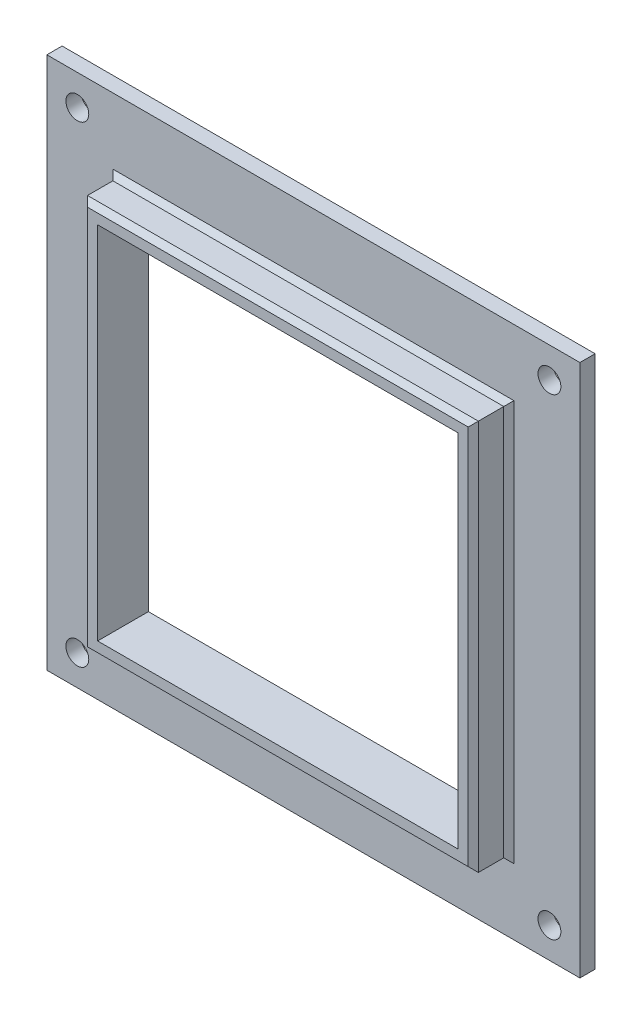
ISO-10303-21;
HEADER;
FILE_DESCRIPTION(('STEP AP214'),'2;1');
FILE_NAME('part.step','',(''),(''),'','','');
FILE_SCHEMA(('AUTOMOTIVE_DESIGN { 1 0 10303 214 1 1 1 1 }'));
ENDSEC;
DATA;
#1=APPLICATION_CONTEXT('core data for automotive mechanical design processes');
#2=APPLICATION_PROTOCOL_DEFINITION('international standard','automotive_design',2000,#1);
#3=PRODUCT_CONTEXT('',#1,'mechanical');
#4=PRODUCT('Part','Part','',(#3));
#5=PRODUCT_RELATED_PRODUCT_CATEGORY('part','',(#4));
#6=PRODUCT_DEFINITION_FORMATION('','',#4);
#7=PRODUCT_DEFINITION_CONTEXT('part definition',#1,'design');
#8=PRODUCT_DEFINITION('design','',#6,#7);
#9=PRODUCT_DEFINITION_SHAPE('','',#8);
#10=(LENGTH_UNIT() NAMED_UNIT(*) SI_UNIT(.MILLI.,.METRE.));
#11=(NAMED_UNIT(*) PLANE_ANGLE_UNIT() SI_UNIT($,.RADIAN.));
#12=(NAMED_UNIT(*) SI_UNIT($,.STERADIAN.) SOLID_ANGLE_UNIT());
#13=UNCERTAINTY_MEASURE_WITH_UNIT(LENGTH_MEASURE(1.E-05),#10,'distance_accuracy_value','');
#14=(GEOMETRIC_REPRESENTATION_CONTEXT(3) GLOBAL_UNCERTAINTY_ASSIGNED_CONTEXT((#13)) GLOBAL_UNIT_ASSIGNED_CONTEXT((#10,
#11,#12)) REPRESENTATION_CONTEXT('',''));
#15=CARTESIAN_POINT('',(0.,0.,0.));
#16=DIRECTION('',(0.,0.,1.));
#17=DIRECTION('',(1.,0.,0.));
#18=AXIS2_PLACEMENT_3D('',#15,#16,#17);
#19=CARTESIAN_POINT('',(0.,0.,3.));
#20=DIRECTION('',(0.,0.,1.));
#21=DIRECTION('',(1.,0.,0.));
#22=AXIS2_PLACEMENT_3D('',#19,#20,#21);
#23=PLANE('',#22);
#24=CARTESIAN_POINT('',(-11.,-11.,3.));
#25=DIRECTION('',(0.,0.,1.));
#26=DIRECTION('',(1.,0.,0.));
#27=AXIS2_PLACEMENT_3D('',#24,#25,#26);
#28=CIRCLE('',#27,2.25);
#29=CARTESIAN_POINT('',(-8.74999999999995,-11.,3.));
#30=VERTEX_POINT('',#29);
#31=EDGE_CURVE('E486',#30,#30,#28,.T.);
#32=ORIENTED_EDGE('',*,*,#31,.F.);
#33=EDGE_LOOP('',(#32));
#34=FACE_BOUND('',#33,.T.);
#35=CARTESIAN_POINT('',(81.9999999999999,-11.,3.));
#36=DIRECTION('',(0.,0.,1.));
#37=DIRECTION('',(1.,0.,0.));
#38=AXIS2_PLACEMENT_3D('',#35,#36,#37);
#39=CIRCLE('',#38,2.25);
#40=CARTESIAN_POINT('',(84.2499999999999,-11.,3.));
#41=VERTEX_POINT('',#40);
#42=EDGE_CURVE('E488',#41,#41,#39,.T.);
#43=ORIENTED_EDGE('',*,*,#42,.F.);
#44=EDGE_LOOP('',(#43));
#45=FACE_BOUND('',#44,.T.);
#46=CARTESIAN_POINT('',(81.9999999999999,82.,3.));
#47=DIRECTION('',(0.,0.,1.));
#48=DIRECTION('',(1.,0.,0.));
#49=AXIS2_PLACEMENT_3D('',#46,#47,#48);
#50=CIRCLE('',#49,2.25);
#51=CARTESIAN_POINT('',(84.2499999999999,82.,3.));
#52=VERTEX_POINT('',#51);
#53=EDGE_CURVE('E494',#52,#52,#50,.T.);
#54=ORIENTED_EDGE('',*,*,#53,.F.);
#55=EDGE_LOOP('',(#54));
#56=FACE_BOUND('',#55,.T.);
#57=CARTESIAN_POINT('',(-11.,82.,3.));
#58=DIRECTION('',(0.,0.,1.));
#59=DIRECTION('',(1.,0.,0.));
#60=AXIS2_PLACEMENT_3D('',#57,#58,#59);
#61=CIRCLE('',#60,2.25);
#62=CARTESIAN_POINT('',(-8.74999999999996,82.,3.));
#63=VERTEX_POINT('',#62);
#64=EDGE_CURVE('E500',#63,#63,#61,.T.);
#65=ORIENTED_EDGE('',*,*,#64,.F.);
#66=EDGE_LOOP('',(#65));
#67=FACE_BOUND('',#66,.T.);
#68=DIRECTION('',(0.,1.,0.));
#69=VECTOR('',#68,1.);
#70=CARTESIAN_POINT('',(-3.99999999999999,0.,3.));
#71=LINE('',#70,#69);
#72=CARTESIAN_POINT('',(-3.99999999999999,-4.,3.));
#73=VERTEX_POINT('',#72);
#74=CARTESIAN_POINT('',(-4.,75.,3.));
#75=VERTEX_POINT('',#74);
#76=EDGE_CURVE('E249',#73,#75,#71,.T.);
#77=ORIENTED_EDGE('',*,*,#76,.T.);
#78=DIRECTION('',(1.,0.,0.));
#79=VECTOR('',#78,1.);
#80=CARTESIAN_POINT('',(0.,75.,3.));
#81=LINE('',#80,#79);
#82=CARTESIAN_POINT('',(75.,75.,3.));
#83=VERTEX_POINT('',#82);
#84=EDGE_CURVE('E251',#75,#83,#81,.T.);
#85=ORIENTED_EDGE('',*,*,#84,.T.);
#86=DIRECTION('',(0.,-1.,0.));
#87=VECTOR('',#86,1.);
#88=CARTESIAN_POINT('',(75.,0.,3.));
#89=LINE('',#88,#87);
#90=CARTESIAN_POINT('',(75.,-4.,3.));
#91=VERTEX_POINT('',#90);
#92=EDGE_CURVE('E247',#83,#91,#89,.T.);
#93=ORIENTED_EDGE('',*,*,#92,.T.);
#94=DIRECTION('',(-1.,0.,0.));
#95=VECTOR('',#94,1.);
#96=CARTESIAN_POINT('',(0.,-4.,3.));
#97=LINE('',#96,#95);
#98=EDGE_CURVE('E245',#91,#73,#97,.T.);
#99=ORIENTED_EDGE('',*,*,#98,.T.);
#100=EDGE_LOOP('',(#77,#85,#93,#99));
#101=FACE_BOUND('',#100,.T.);
#102=DIRECTION('',(0.,-1.,0.));
#103=VECTOR('',#102,1.);
#104=CARTESIAN_POINT('',(-17.,88.,3.));
#105=LINE('',#104,#103);
#106=CARTESIAN_POINT('',(-17.,88.,3.));
#107=VERTEX_POINT('',#106);
#108=CARTESIAN_POINT('',(-16.9999999999999,-17.,3.));
#109=VERTEX_POINT('',#108);
#110=EDGE_CURVE('E210',#107,#109,#105,.T.);
#111=ORIENTED_EDGE('',*,*,#110,.T.);
#112=DIRECTION('',(1.,0.,0.));
#113=VECTOR('',#112,1.);
#114=CARTESIAN_POINT('',(-16.9999999999999,-17.,3.));
#115=LINE('',#114,#113);
#116=CARTESIAN_POINT('',(88.,-17.,3.));
#117=VERTEX_POINT('',#116);
#118=EDGE_CURVE('E213',#109,#117,#115,.T.);
#119=ORIENTED_EDGE('',*,*,#118,.T.);
#120=DIRECTION('',(0.,1.,0.));
#121=VECTOR('',#120,1.);
#122=CARTESIAN_POINT('',(87.9999999999999,88.,3.));
#123=LINE('',#122,#121);
#124=CARTESIAN_POINT('',(87.9999999999999,88.,3.));
#125=VERTEX_POINT('',#124);
#126=EDGE_CURVE('E216',#117,#125,#123,.T.);
#127=ORIENTED_EDGE('',*,*,#126,.T.);
#128=DIRECTION('',(-1.,0.,0.));
#129=VECTOR('',#128,1.);
#130=CARTESIAN_POINT('',(-17.,88.,3.));
#131=LINE('',#130,#129);
#132=EDGE_CURVE('E218',#125,#107,#131,.T.);
#133=ORIENTED_EDGE('',*,*,#132,.T.);
#134=EDGE_LOOP('',(#111,#119,#127,#133));
#135=FACE_BOUND('',#134,.T.);
#136=ADVANCED_FACE('F37',(#34,#45,#56,#67,#101,#135),#23,.T.);
#137=CARTESIAN_POINT('',(0.,0.,0.));
#138=DIRECTION('',(0.,0.,1.));
#139=DIRECTION('',(1.,0.,0.));
#140=AXIS2_PLACEMENT_3D('',#137,#138,#139);
#141=PLANE('',#140);
#142=CARTESIAN_POINT('',(-11.,-11.,0.));
#143=DIRECTION('',(0.,0.,1.));
#144=DIRECTION('',(1.,0.,0.));
#145=AXIS2_PLACEMENT_3D('',#142,#143,#144);
#146=CIRCLE('',#145,2.25);
#147=CARTESIAN_POINT('',(-8.74999999999995,-11.,0.));
#148=VERTEX_POINT('',#147);
#149=EDGE_CURVE('E484',#148,#148,#146,.T.);
#150=ORIENTED_EDGE('',*,*,#149,.T.);
#151=EDGE_LOOP('',(#150));
#152=FACE_BOUND('',#151,.T.);
#153=CARTESIAN_POINT('',(81.9999999999999,-11.,0.));
#154=DIRECTION('',(0.,0.,1.));
#155=DIRECTION('',(1.,0.,0.));
#156=AXIS2_PLACEMENT_3D('',#153,#154,#155);
#157=CIRCLE('',#156,2.25);
#158=CARTESIAN_POINT('',(84.2499999999999,-11.,0.));
#159=VERTEX_POINT('',#158);
#160=EDGE_CURVE('E491',#159,#159,#157,.T.);
#161=ORIENTED_EDGE('',*,*,#160,.T.);
#162=EDGE_LOOP('',(#161));
#163=FACE_BOUND('',#162,.T.);
#164=CARTESIAN_POINT('',(81.9999999999999,82.,0.));
#165=DIRECTION('',(0.,0.,1.));
#166=DIRECTION('',(1.,0.,0.));
#167=AXIS2_PLACEMENT_3D('',#164,#165,#166);
#168=CIRCLE('',#167,2.25);
#169=CARTESIAN_POINT('',(84.2499999999999,82.,0.));
#170=VERTEX_POINT('',#169);
#171=EDGE_CURVE('E497',#170,#170,#168,.T.);
#172=ORIENTED_EDGE('',*,*,#171,.T.);
#173=EDGE_LOOP('',(#172));
#174=FACE_BOUND('',#173,.T.);
#175=CARTESIAN_POINT('',(-11.,82.,0.));
#176=DIRECTION('',(0.,0.,1.));
#177=DIRECTION('',(1.,0.,0.));
#178=AXIS2_PLACEMENT_3D('',#175,#176,#177);
#179=CIRCLE('',#178,2.25);
#180=CARTESIAN_POINT('',(-8.74999999999996,82.,0.));
#181=VERTEX_POINT('',#180);
#182=EDGE_CURVE('E282',#181,#181,#179,.T.);
#183=ORIENTED_EDGE('',*,*,#182,.T.);
#184=EDGE_LOOP('',(#183));
#185=FACE_BOUND('',#184,.T.);
#186=DIRECTION('',(0.,-1.,0.));
#187=VECTOR('',#186,1.);
#188=CARTESIAN_POINT('',(-17.,88.,0.));
#189=LINE('',#188,#187);
#190=CARTESIAN_POINT('',(-17.,88.,0.));
#191=VERTEX_POINT('',#190);
#192=CARTESIAN_POINT('',(-16.9999999999999,-17.,0.));
#193=VERTEX_POINT('',#192);
#194=EDGE_CURVE('E209',#191,#193,#189,.T.);
#195=ORIENTED_EDGE('',*,*,#194,.F.);
#196=DIRECTION('',(-1.,0.,0.));
#197=VECTOR('',#196,1.);
#198=CARTESIAN_POINT('',(-17.,88.,0.));
#199=LINE('',#198,#197);
#200=CARTESIAN_POINT('',(87.9999999999999,88.,0.));
#201=VERTEX_POINT('',#200);
#202=EDGE_CURVE('E214',#201,#191,#199,.T.);
#203=ORIENTED_EDGE('',*,*,#202,.F.);
#204=DIRECTION('',(0.,1.,0.));
#205=VECTOR('',#204,1.);
#206=CARTESIAN_POINT('',(87.9999999999999,88.,0.));
#207=LINE('',#206,#205);
#208=CARTESIAN_POINT('',(88.,-17.,0.));
#209=VERTEX_POINT('',#208);
#210=EDGE_CURVE('E225',#209,#201,#207,.T.);
#211=ORIENTED_EDGE('',*,*,#210,.F.);
#212=DIRECTION('',(1.,0.,0.));
#213=VECTOR('',#212,1.);
#214=CARTESIAN_POINT('',(-16.9999999999999,-17.,0.));
#215=LINE('',#214,#213);
#216=EDGE_CURVE('E223',#193,#209,#215,.T.);
#217=ORIENTED_EDGE('',*,*,#216,.F.);
#218=EDGE_LOOP('',(#195,#203,#211,#217));
#219=FACE_BOUND('',#218,.T.);
#220=DIRECTION('',(0.,-1.,0.));
#221=VECTOR('',#220,1.);
#222=CARTESIAN_POINT('',(0.,0.,0.));
#223=LINE('',#222,#221);
#224=CARTESIAN_POINT('',(0.,71.,0.));
#225=VERTEX_POINT('',#224);
#226=CARTESIAN_POINT('',(0.,0.,0.));
#227=VERTEX_POINT('',#226);
#228=EDGE_CURVE('E195',#225,#227,#223,.T.);
#229=ORIENTED_EDGE('',*,*,#228,.T.);
#230=DIRECTION('',(1.,0.,0.));
#231=VECTOR('',#230,1.);
#232=CARTESIAN_POINT('',(0.,0.,0.));
#233=LINE('',#232,#231);
#234=CARTESIAN_POINT('',(71.,0.,0.));
#235=VERTEX_POINT('',#234);
#236=EDGE_CURVE('E198',#227,#235,#233,.T.);
#237=ORIENTED_EDGE('',*,*,#236,.T.);
#238=DIRECTION('',(0.,1.,0.));
#239=VECTOR('',#238,1.);
#240=CARTESIAN_POINT('',(71.,0.,0.));
#241=LINE('',#240,#239);
#242=CARTESIAN_POINT('',(71.,71.,0.));
#243=VERTEX_POINT('',#242);
#244=EDGE_CURVE('E159',#235,#243,#241,.T.);
#245=ORIENTED_EDGE('',*,*,#244,.T.);
#246=DIRECTION('',(-1.,0.,0.));
#247=VECTOR('',#246,1.);
#248=CARTESIAN_POINT('',(0.,71.,0.));
#249=LINE('',#248,#247);
#250=EDGE_CURVE('E201',#243,#225,#249,.T.);
#251=ORIENTED_EDGE('',*,*,#250,.T.);
#252=EDGE_LOOP('',(#229,#237,#245,#251));
#253=FACE_BOUND('',#252,.T.);
#254=ADVANCED_FACE('F340',(#152,#163,#174,#185,#219,#253),#141,.F.);
#255=CARTESIAN_POINT('',(-17.,88.,3.));
#256=DIRECTION('',(1.,0.,0.));
#257=DIRECTION('',(0.,1.,0.));
#258=AXIS2_PLACEMENT_3D('',#255,#256,#257);
#259=PLANE('',#258);
#260=ORIENTED_EDGE('',*,*,#194,.T.);
#261=DIRECTION('',(0.,0.,-1.));
#262=VECTOR('',#261,1.);
#263=CARTESIAN_POINT('',(-16.9999999999999,-17.,3.));
#264=LINE('',#263,#262);
#265=EDGE_CURVE('E236',#109,#193,#264,.T.);
#266=ORIENTED_EDGE('',*,*,#265,.F.);
#267=ORIENTED_EDGE('',*,*,#110,.F.);
#268=DIRECTION('',(0.,0.,-1.));
#269=VECTOR('',#268,1.);
#270=CARTESIAN_POINT('',(-17.,88.,3.));
#271=LINE('',#270,#269);
#272=EDGE_CURVE('E220',#107,#191,#271,.T.);
#273=ORIENTED_EDGE('',*,*,#272,.T.);
#274=EDGE_LOOP('',(#260,#266,#267,#273));
#275=FACE_BOUND('',#274,.T.);
#276=ADVANCED_FACE('F346',(#275),#259,.F.);
#277=CARTESIAN_POINT('',(-16.9999999999999,-17.,3.));
#278=DIRECTION('',(0.,1.,0.));
#279=DIRECTION('',(-1.,0.,0.));
#280=AXIS2_PLACEMENT_3D('',#277,#278,#279);
#281=PLANE('',#280);
#282=ORIENTED_EDGE('',*,*,#216,.T.);
#283=DIRECTION('',(0.,0.,-1.));
#284=VECTOR('',#283,1.);
#285=CARTESIAN_POINT('',(88.,-17.,3.));
#286=LINE('',#285,#284);
#287=EDGE_CURVE('E233',#117,#209,#286,.T.);
#288=ORIENTED_EDGE('',*,*,#287,.F.);
#289=ORIENTED_EDGE('',*,*,#118,.F.);
#290=ORIENTED_EDGE('',*,*,#265,.T.);
#291=EDGE_LOOP('',(#282,#288,#289,#290));
#292=FACE_BOUND('',#291,.T.);
#293=ADVANCED_FACE('F362',(#292),#281,.F.);
#294=CARTESIAN_POINT('',(87.9999999999999,88.,3.));
#295=DIRECTION('',(-1.,0.,0.));
#296=DIRECTION('',(0.,-1.,0.));
#297=AXIS2_PLACEMENT_3D('',#294,#295,#296);
#298=PLANE('',#297);
#299=ORIENTED_EDGE('',*,*,#210,.T.);
#300=DIRECTION('',(0.,0.,-1.));
#301=VECTOR('',#300,1.);
#302=CARTESIAN_POINT('',(87.9999999999999,88.,3.));
#303=LINE('',#302,#301);
#304=EDGE_CURVE('E230',#125,#201,#303,.T.);
#305=ORIENTED_EDGE('',*,*,#304,.F.);
#306=ORIENTED_EDGE('',*,*,#126,.F.);
#307=ORIENTED_EDGE('',*,*,#287,.T.);
#308=EDGE_LOOP('',(#299,#305,#306,#307));
#309=FACE_BOUND('',#308,.T.);
#310=ADVANCED_FACE('F358',(#309),#298,.F.);
#311=CARTESIAN_POINT('',(-17.,88.,3.));
#312=DIRECTION('',(0.,-1.,0.));
#313=DIRECTION('',(1.,0.,0.));
#314=AXIS2_PLACEMENT_3D('',#311,#312,#313);
#315=PLANE('',#314);
#316=ORIENTED_EDGE('',*,*,#202,.T.);
#317=ORIENTED_EDGE('',*,*,#272,.F.);
#318=ORIENTED_EDGE('',*,*,#132,.F.);
#319=ORIENTED_EDGE('',*,*,#304,.T.);
#320=EDGE_LOOP('',(#316,#317,#318,#319));
#321=FACE_BOUND('',#320,.T.);
#322=ADVANCED_FACE('F355',(#321),#315,.F.);
#323=CARTESIAN_POINT('',(0.,0.,3.));
#324=DIRECTION('',(1.,0.,0.));
#325=DIRECTION('',(0.,0.,-1.));
#326=AXIS2_PLACEMENT_3D('',#323,#324,#325);
#327=PLANE('',#326);
#328=ORIENTED_EDGE('',*,*,#228,.F.);
#329=DIRECTION('',(0.,0.,-1.));
#330=VECTOR('',#329,1.);
#331=CARTESIAN_POINT('',(0.,71.,3.));
#332=LINE('',#331,#330);
#333=CARTESIAN_POINT('',(0.,71.,10.));
#334=VERTEX_POINT('',#333);
#335=EDGE_CURVE('E204',#334,#225,#332,.T.);
#336=ORIENTED_EDGE('',*,*,#335,.F.);
#337=DIRECTION('',(0.,-1.,0.));
#338=VECTOR('',#337,1.);
#339=CARTESIAN_POINT('',(0.,71.,10.));
#340=LINE('',#339,#338);
#341=CARTESIAN_POINT('',(0.,0.,10.));
#342=VERTEX_POINT('',#341);
#343=EDGE_CURVE('E178',#334,#342,#340,.T.);
#344=ORIENTED_EDGE('',*,*,#343,.T.);
#345=DIRECTION('',(0.,0.,-1.));
#346=VECTOR('',#345,1.);
#347=CARTESIAN_POINT('',(0.,0.,3.));
#348=LINE('',#347,#346);
#349=EDGE_CURVE('E162',#342,#227,#348,.T.);
#350=ORIENTED_EDGE('',*,*,#349,.T.);
#351=EDGE_LOOP('',(#328,#336,#344,#350));
#352=FACE_BOUND('',#351,.T.);
#353=ADVANCED_FACE('F352',(#352),#327,.T.);
#354=CARTESIAN_POINT('',(0.,0.,3.));
#355=DIRECTION('',(0.,1.,0.));
#356=DIRECTION('',(0.,0.,1.));
#357=AXIS2_PLACEMENT_3D('',#354,#355,#356);
#358=PLANE('',#357);
#359=ORIENTED_EDGE('',*,*,#236,.F.);
#360=ORIENTED_EDGE('',*,*,#349,.F.);
#361=DIRECTION('',(1.,0.,0.));
#362=VECTOR('',#361,1.);
#363=CARTESIAN_POINT('',(0.,0.,10.));
#364=LINE('',#363,#362);
#365=CARTESIAN_POINT('',(71.,0.,10.));
#366=VERTEX_POINT('',#365);
#367=EDGE_CURVE('E166',#342,#366,#364,.T.);
#368=ORIENTED_EDGE('',*,*,#367,.T.);
#369=DIRECTION('',(0.,0.,-1.));
#370=VECTOR('',#369,1.);
#371=CARTESIAN_POINT('',(71.,0.,3.));
#372=LINE('',#371,#370);
#373=EDGE_CURVE('E152',#366,#235,#372,.T.);
#374=ORIENTED_EDGE('',*,*,#373,.T.);
#375=EDGE_LOOP('',(#359,#360,#368,#374));
#376=FACE_BOUND('',#375,.T.);
#377=ADVANCED_FACE('F167',(#376),#358,.T.);
#378=CARTESIAN_POINT('',(71.,0.,3.));
#379=DIRECTION('',(-1.,0.,0.));
#380=DIRECTION('',(0.,-1.,0.));
#381=AXIS2_PLACEMENT_3D('',#378,#379,#380);
#382=PLANE('',#381);
#383=ORIENTED_EDGE('',*,*,#244,.F.);
#384=ORIENTED_EDGE('',*,*,#373,.F.);
#385=DIRECTION('',(0.,1.,0.));
#386=VECTOR('',#385,1.);
#387=CARTESIAN_POINT('',(71.,0.,10.));
#388=LINE('',#387,#386);
#389=CARTESIAN_POINT('',(71.,71.,10.));
#390=VERTEX_POINT('',#389);
#391=EDGE_CURVE('E156',#366,#390,#388,.T.);
#392=ORIENTED_EDGE('',*,*,#391,.T.);
#393=DIRECTION('',(0.,0.,-1.));
#394=VECTOR('',#393,1.);
#395=CARTESIAN_POINT('',(71.,71.,3.));
#396=LINE('',#395,#394);
#397=EDGE_CURVE('E163',#390,#243,#396,.T.);
#398=ORIENTED_EDGE('',*,*,#397,.T.);
#399=EDGE_LOOP('',(#383,#384,#392,#398));
#400=FACE_BOUND('',#399,.T.);
#401=ADVANCED_FACE('F154',(#400),#382,.T.);
#402=CARTESIAN_POINT('',(0.,71.,3.));
#403=DIRECTION('',(0.,-1.,0.));
#404=DIRECTION('',(0.,0.,-1.));
#405=AXIS2_PLACEMENT_3D('',#402,#403,#404);
#406=PLANE('',#405);
#407=ORIENTED_EDGE('',*,*,#250,.F.);
#408=ORIENTED_EDGE('',*,*,#397,.F.);
#409=DIRECTION('',(-1.,0.,0.));
#410=VECTOR('',#409,1.);
#411=CARTESIAN_POINT('',(71.,71.,10.));
#412=LINE('',#411,#410);
#413=EDGE_CURVE('E176',#390,#334,#412,.T.);
#414=ORIENTED_EDGE('',*,*,#413,.T.);
#415=ORIENTED_EDGE('',*,*,#335,.T.);
#416=EDGE_LOOP('',(#407,#408,#414,#415));
#417=FACE_BOUND('',#416,.T.);
#418=ADVANCED_FACE('F393',(#417),#406,.T.);
#419=CARTESIAN_POINT('',(0.,0.,10.));
#420=DIRECTION('',(0.,0.,1.));
#421=DIRECTION('',(1.,0.,0.));
#422=AXIS2_PLACEMENT_3D('',#419,#420,#421);
#423=PLANE('',#422);
#424=DIRECTION('',(0.,1.,0.));
#425=VECTOR('',#424,1.);
#426=CARTESIAN_POINT('',(73.,74.,10.));
#427=LINE('',#426,#425);
#428=CARTESIAN_POINT('',(73.,-2.00000000000004,10.));
#429=VERTEX_POINT('',#428);
#430=CARTESIAN_POINT('',(73.,73.,10.));
#431=VERTEX_POINT('',#430);
#432=EDGE_CURVE('E266',#429,#431,#427,.T.);
#433=ORIENTED_EDGE('',*,*,#432,.T.);
#434=DIRECTION('',(-1.,0.,0.));
#435=VECTOR('',#434,1.);
#436=CARTESIAN_POINT('',(-3.,73.,10.));
#437=LINE('',#436,#435);
#438=CARTESIAN_POINT('',(-2.00000000000004,73.,10.));
#439=VERTEX_POINT('',#438);
#440=EDGE_CURVE('E11',#431,#439,#437,.T.);
#441=ORIENTED_EDGE('',*,*,#440,.T.);
#442=DIRECTION('',(0.,-1.,0.));
#443=VECTOR('',#442,1.);
#444=CARTESIAN_POINT('',(-2.00000000000004,-3.,10.));
#445=LINE('',#444,#443);
#446=CARTESIAN_POINT('',(-2.00000000000004,-2.00000000000004,10.));
#447=VERTEX_POINT('',#446);
#448=EDGE_CURVE('E46',#439,#447,#445,.T.);
#449=ORIENTED_EDGE('',*,*,#448,.T.);
#450=DIRECTION('',(1.,0.,0.));
#451=VECTOR('',#450,1.);
#452=CARTESIAN_POINT('',(74.,-2.00000000000004,10.));
#453=LINE('',#452,#451);
#454=EDGE_CURVE('E268',#447,#429,#453,.T.);
#455=ORIENTED_EDGE('',*,*,#454,.T.);
#456=EDGE_LOOP('',(#433,#441,#449,#455));
#457=FACE_BOUND('',#456,.T.);
#458=ORIENTED_EDGE('',*,*,#391,.F.);
#459=ORIENTED_EDGE('',*,*,#367,.F.);
#460=ORIENTED_EDGE('',*,*,#343,.F.);
#461=ORIENTED_EDGE('',*,*,#413,.F.);
#462=EDGE_LOOP('',(#458,#459,#460,#461));
#463=FACE_BOUND('',#462,.T.);
#464=ADVANCED_FACE('F174',(#457,#463),#423,.T.);
#465=CARTESIAN_POINT('',(-3.,74.,10.));
#466=DIRECTION('',(1.,0.,0.));
#467=DIRECTION('',(0.,1.,0.));
#468=AXIS2_PLACEMENT_3D('',#465,#466,#467);
#469=PLANE('',#468);
#470=DIRECTION('',(0.,0.,-1.));
#471=VECTOR('',#470,1.);
#472=CARTESIAN_POINT('',(-3.,74.,10.));
#473=LINE('',#472,#471);
#474=CARTESIAN_POINT('',(-3.,74.,9.00000000000004));
#475=VERTEX_POINT('',#474);
#476=CARTESIAN_POINT('',(-3.,74.,4.));
#477=VERTEX_POINT('',#476);
#478=EDGE_CURVE('E183',#475,#477,#473,.T.);
#479=ORIENTED_EDGE('',*,*,#478,.T.);
#480=DIRECTION('',(0.,-1.,0.));
#481=VECTOR('',#480,1.);
#482=CARTESIAN_POINT('',(-3.,74.,4.));
#483=LINE('',#482,#481);
#484=CARTESIAN_POINT('',(-2.99999999999999,-3.,4.));
#485=VERTEX_POINT('',#484);
#486=EDGE_CURVE('E256',#477,#485,#483,.T.);
#487=ORIENTED_EDGE('',*,*,#486,.T.);
#488=DIRECTION('',(0.,0.,-1.));
#489=VECTOR('',#488,1.);
#490=CARTESIAN_POINT('',(-2.99999999999999,-3.,10.));
#491=LINE('',#490,#489);
#492=CARTESIAN_POINT('',(-2.99999999999999,-3.,9.00000000000004));
#493=VERTEX_POINT('',#492);
#494=EDGE_CURVE('E192',#493,#485,#491,.T.);
#495=ORIENTED_EDGE('',*,*,#494,.F.);
#496=DIRECTION('',(0.,1.,0.));
#497=VECTOR('',#496,1.);
#498=CARTESIAN_POINT('',(-3.,74.,9.00000000000004));
#499=LINE('',#498,#497);
#500=EDGE_CURVE('E254',#493,#475,#499,.T.);
#501=ORIENTED_EDGE('',*,*,#500,.T.);
#502=EDGE_LOOP('',(#479,#487,#495,#501));
#503=FACE_BOUND('',#502,.T.);
#504=ADVANCED_FACE('F303',(#503),#469,.F.);
#505=CARTESIAN_POINT('',(-2.99999999999999,-3.,10.));
#506=DIRECTION('',(0.,1.,0.));
#507=DIRECTION('',(-1.,0.,0.));
#508=AXIS2_PLACEMENT_3D('',#505,#506,#507);
#509=PLANE('',#508);
#510=ORIENTED_EDGE('',*,*,#494,.T.);
#511=DIRECTION('',(1.,0.,0.));
#512=VECTOR('',#511,1.);
#513=CARTESIAN_POINT('',(-2.99999999999999,-3.,4.));
#514=LINE('',#513,#512);
#515=CARTESIAN_POINT('',(74.,-3.,4.));
#516=VERTEX_POINT('',#515);
#517=EDGE_CURVE('E264',#485,#516,#514,.T.);
#518=ORIENTED_EDGE('',*,*,#517,.T.);
#519=DIRECTION('',(0.,0.,-1.));
#520=VECTOR('',#519,1.);
#521=CARTESIAN_POINT('',(74.,-3.,10.));
#522=LINE('',#521,#520);
#523=CARTESIAN_POINT('',(74.,-3.,9.00000000000004));
#524=VERTEX_POINT('',#523);
#525=EDGE_CURVE('E189',#524,#516,#522,.T.);
#526=ORIENTED_EDGE('',*,*,#525,.F.);
#527=DIRECTION('',(-1.,0.,0.));
#528=VECTOR('',#527,1.);
#529=CARTESIAN_POINT('',(-2.99999999999999,-3.,9.00000000000004));
#530=LINE('',#529,#528);
#531=EDGE_CURVE('E262',#524,#493,#530,.T.);
#532=ORIENTED_EDGE('',*,*,#531,.T.);
#533=EDGE_LOOP('',(#510,#518,#526,#532));
#534=FACE_BOUND('',#533,.T.);
#535=ADVANCED_FACE('F300',(#534),#509,.F.);
#536=CARTESIAN_POINT('',(74.,74.,10.));
#537=DIRECTION('',(-1.,0.,0.));
#538=DIRECTION('',(0.,0.,1.));
#539=AXIS2_PLACEMENT_3D('',#536,#537,#538);
#540=PLANE('',#539);
#541=ORIENTED_EDGE('',*,*,#525,.T.);
#542=DIRECTION('',(0.,1.,0.));
#543=VECTOR('',#542,1.);
#544=CARTESIAN_POINT('',(74.,74.,4.));
#545=LINE('',#544,#543);
#546=CARTESIAN_POINT('',(74.,74.,4.));
#547=VERTEX_POINT('',#546);
#548=EDGE_CURVE('E260',#516,#547,#545,.T.);
#549=ORIENTED_EDGE('',*,*,#548,.T.);
#550=DIRECTION('',(0.,0.,-1.));
#551=VECTOR('',#550,1.);
#552=CARTESIAN_POINT('',(74.,74.,10.));
#553=LINE('',#552,#551);
#554=CARTESIAN_POINT('',(74.,74.,9.00000000000004));
#555=VERTEX_POINT('',#554);
#556=EDGE_CURVE('E186',#555,#547,#553,.T.);
#557=ORIENTED_EDGE('',*,*,#556,.F.);
#558=DIRECTION('',(0.,-1.,0.));
#559=VECTOR('',#558,1.);
#560=CARTESIAN_POINT('',(74.,-3.,9.00000000000004));
#561=LINE('',#560,#559);
#562=EDGE_CURVE('E258',#555,#524,#561,.T.);
#563=ORIENTED_EDGE('',*,*,#562,.T.);
#564=EDGE_LOOP('',(#541,#549,#557,#563));
#565=FACE_BOUND('',#564,.T.);
#566=ADVANCED_FACE('F328',(#565),#540,.F.);
#567=CARTESIAN_POINT('',(-3.,74.,10.));
#568=DIRECTION('',(0.,-1.,0.));
#569=DIRECTION('',(0.,0.,-1.));
#570=AXIS2_PLACEMENT_3D('',#567,#568,#569);
#571=PLANE('',#570);
#572=ORIENTED_EDGE('',*,*,#556,.T.);
#573=DIRECTION('',(-1.,0.,0.));
#574=VECTOR('',#573,1.);
#575=CARTESIAN_POINT('',(-3.,74.,4.));
#576=LINE('',#575,#574);
#577=EDGE_CURVE('E242',#547,#477,#576,.T.);
#578=ORIENTED_EDGE('',*,*,#577,.T.);
#579=ORIENTED_EDGE('',*,*,#478,.F.);
#580=DIRECTION('',(1.,0.,0.));
#581=VECTOR('',#580,1.);
#582=CARTESIAN_POINT('',(74.,74.,9.00000000000004));
#583=LINE('',#582,#581);
#584=EDGE_CURVE('E239',#475,#555,#583,.T.);
#585=ORIENTED_EDGE('',*,*,#584,.T.);
#586=EDGE_LOOP('',(#572,#578,#579,#585));
#587=FACE_BOUND('',#586,.T.);
#588=ADVANCED_FACE('F313',(#587),#571,.F.);
#589=CARTESIAN_POINT('',(-2.99999999999999,-3.,4.));
#590=DIRECTION('',(0.,0.707106781186547,-0.707106781186548));
#591=DIRECTION('',(1.,0.,0.));
#592=AXIS2_PLACEMENT_3D('',#589,#590,#591);
#593=PLANE('',#592);
#594=DIRECTION('',(-0.577350269189625,-0.577350269189626,-0.577350269189626));
#595=VECTOR('',#594,1.);
#596=CARTESIAN_POINT('',(-2.99999999999999,-3.,4.));
#597=LINE('',#596,#595);
#598=EDGE_CURVE('E275',#73,#485,#597,.F.);
#599=ORIENTED_EDGE('',*,*,#598,.F.);
#600=ORIENTED_EDGE('',*,*,#98,.F.);
#601=DIRECTION('',(-0.577350269189626,0.577350269189626,0.577350269189626));
#602=VECTOR('',#601,1.);
#603=CARTESIAN_POINT('',(48.3333333333333,22.6666666666667,29.6666666666666));
#604=LINE('',#603,#602);
#605=EDGE_CURVE('E172',#516,#91,#604,.F.);
#606=ORIENTED_EDGE('',*,*,#605,.F.);
#607=ORIENTED_EDGE('',*,*,#517,.F.);
#608=EDGE_LOOP('',(#599,#600,#606,#607));
#609=FACE_BOUND('',#608,.T.);
#610=ADVANCED_FACE('F325',(#609),#593,.F.);
#611=CARTESIAN_POINT('',(74.,74.,4.));
#612=DIRECTION('',(-0.707106781186547,0.,-0.707106781186547));
#613=DIRECTION('',(0.,1.,0.));
#614=AXIS2_PLACEMENT_3D('',#611,#612,#613);
#615=PLANE('',#614);
#616=ORIENTED_EDGE('',*,*,#605,.T.);
#617=ORIENTED_EDGE('',*,*,#92,.F.);
#618=DIRECTION('',(-0.577350269189626,-0.577350269189626,0.577350269189626));
#619=VECTOR('',#618,1.);
#620=CARTESIAN_POINT('',(74.,74.,4.));
#621=LINE('',#620,#619);
#622=EDGE_CURVE('E273',#547,#83,#621,.F.);
#623=ORIENTED_EDGE('',*,*,#622,.F.);
#624=ORIENTED_EDGE('',*,*,#548,.F.);
#625=EDGE_LOOP('',(#616,#617,#623,#624));
#626=FACE_BOUND('',#625,.T.);
#627=ADVANCED_FACE('F330',(#626),#615,.F.);
#628=CARTESIAN_POINT('',(-3.,74.,4.));
#629=DIRECTION('',(0.707106781186548,0.,-0.707106781186547));
#630=DIRECTION('',(0.,-1.,0.));
#631=AXIS2_PLACEMENT_3D('',#628,#629,#630);
#632=PLANE('',#631);
#633=ORIENTED_EDGE('',*,*,#598,.T.);
#634=ORIENTED_EDGE('',*,*,#486,.F.);
#635=DIRECTION('',(-0.577350269189625,0.577350269189626,-0.577350269189626));
#636=VECTOR('',#635,1.);
#637=CARTESIAN_POINT('',(-3.,74.,4.));
#638=LINE('',#637,#636);
#639=EDGE_CURVE('E271',#75,#477,#638,.F.);
#640=ORIENTED_EDGE('',*,*,#639,.F.);
#641=ORIENTED_EDGE('',*,*,#76,.F.);
#642=EDGE_LOOP('',(#633,#634,#640,#641));
#643=FACE_BOUND('',#642,.T.);
#644=ADVANCED_FACE('F308',(#643),#632,.F.);
#645=CARTESIAN_POINT('',(-3.,74.,4.));
#646=DIRECTION('',(0.,-0.707106781186547,-0.707106781186547));
#647=DIRECTION('',(-1.,0.,0.));
#648=AXIS2_PLACEMENT_3D('',#645,#646,#647);
#649=PLANE('',#648);
#650=ORIENTED_EDGE('',*,*,#622,.T.);
#651=ORIENTED_EDGE('',*,*,#84,.F.);
#652=ORIENTED_EDGE('',*,*,#639,.T.);
#653=ORIENTED_EDGE('',*,*,#577,.F.);
#654=EDGE_LOOP('',(#650,#651,#652,#653));
#655=FACE_BOUND('',#654,.T.);
#656=ADVANCED_FACE('F317',(#655),#649,.F.);
#657=CARTESIAN_POINT('',(0.,-2.00000000000004,10.));
#658=DIRECTION('',(0.,-0.707106781186548,0.707106781186548));
#659=DIRECTION('',(-1.,0.,0.));
#660=AXIS2_PLACEMENT_3D('',#657,#658,#659);
#661=PLANE('',#660);
#662=DIRECTION('',(-0.577350269189626,-0.577350269189626,-0.577350269189626));
#663=VECTOR('',#662,1.);
#664=CARTESIAN_POINT('',(-1.33333333333336,-1.33333333333336,10.6666666666667));
#665=LINE('',#664,#663);
#666=EDGE_CURVE('E283',#493,#447,#665,.F.);
#667=ORIENTED_EDGE('',*,*,#666,.F.);
#668=ORIENTED_EDGE('',*,*,#531,.F.);
#669=DIRECTION('',(0.577350269189626,-0.577350269189626,-0.577350269189626));
#670=VECTOR('',#669,1.);
#671=CARTESIAN_POINT('',(72.3333333333333,-1.33333333333336,10.6666666666667));
#672=LINE('',#671,#670);
#673=EDGE_CURVE('E41',#429,#524,#672,.T.);
#674=ORIENTED_EDGE('',*,*,#673,.F.);
#675=ORIENTED_EDGE('',*,*,#454,.F.);
#676=EDGE_LOOP('',(#667,#668,#674,#675));
#677=FACE_BOUND('',#676,.T.);
#678=ADVANCED_FACE('F39',(#677),#661,.T.);
#679=CARTESIAN_POINT('',(73.,0.,10.));
#680=DIRECTION('',(0.707106781186548,0.,0.707106781186548));
#681=DIRECTION('',(0.,-1.,0.));
#682=AXIS2_PLACEMENT_3D('',#679,#680,#681);
#683=PLANE('',#682);
#684=ORIENTED_EDGE('',*,*,#673,.T.);
#685=ORIENTED_EDGE('',*,*,#562,.F.);
#686=DIRECTION('',(-0.577350269189626,-0.577350269189626,0.577350269189626));
#687=VECTOR('',#686,1.);
#688=CARTESIAN_POINT('',(48.6666666666667,48.6666666666667,34.3333333333333));
#689=LINE('',#688,#687);
#690=EDGE_CURVE('E281',#431,#555,#689,.F.);
#691=ORIENTED_EDGE('',*,*,#690,.F.);
#692=ORIENTED_EDGE('',*,*,#432,.F.);
#693=EDGE_LOOP('',(#684,#685,#691,#692));
#694=FACE_BOUND('',#693,.T.);
#695=ADVANCED_FACE('F293',(#694),#683,.T.);
#696=CARTESIAN_POINT('',(-2.00000000000004,0.,10.));
#697=DIRECTION('',(-0.707106781186548,0.,0.707106781186548));
#698=DIRECTION('',(0.,1.,0.));
#699=AXIS2_PLACEMENT_3D('',#696,#697,#698);
#700=PLANE('',#699);
#701=ORIENTED_EDGE('',*,*,#666,.T.);
#702=ORIENTED_EDGE('',*,*,#448,.F.);
#703=DIRECTION('',(-0.577350269189626,0.577350269189626,-0.577350269189626));
#704=VECTOR('',#703,1.);
#705=CARTESIAN_POINT('',(22.3333333333333,48.6666666666667,34.3333333333333));
#706=LINE('',#705,#704);
#707=EDGE_CURVE('E54',#475,#439,#706,.F.);
#708=ORIENTED_EDGE('',*,*,#707,.F.);
#709=ORIENTED_EDGE('',*,*,#500,.F.);
#710=EDGE_LOOP('',(#701,#702,#708,#709));
#711=FACE_BOUND('',#710,.T.);
#712=ADVANCED_FACE('F377',(#711),#700,.T.);
#713=CARTESIAN_POINT('',(0.,73.,10.));
#714=DIRECTION('',(0.,0.707106781186548,0.707106781186548));
#715=DIRECTION('',(1.,0.,0.));
#716=AXIS2_PLACEMENT_3D('',#713,#714,#715);
#717=PLANE('',#716);
#718=ORIENTED_EDGE('',*,*,#690,.T.);
#719=ORIENTED_EDGE('',*,*,#584,.F.);
#720=ORIENTED_EDGE('',*,*,#707,.T.);
#721=ORIENTED_EDGE('',*,*,#440,.F.);
#722=EDGE_LOOP('',(#718,#719,#720,#721));
#723=FACE_BOUND('',#722,.T.);
#724=ADVANCED_FACE('F381',(#723),#717,.T.);
#725=CARTESIAN_POINT('',(-11.,82.,0.));
#726=DIRECTION('',(0.,0.,1.));
#727=DIRECTION('',(1.,0.,0.));
#728=AXIS2_PLACEMENT_3D('',#725,#726,#727);
#729=CYLINDRICAL_SURFACE('',#728,2.25);
#730=ORIENTED_EDGE('',*,*,#182,.F.);
#731=EDGE_LOOP('',(#730));
#732=FACE_BOUND('',#731,.T.);
#733=ORIENTED_EDGE('',*,*,#64,.T.);
#734=EDGE_LOOP('',(#733));
#735=FACE_BOUND('',#734,.T.);
#736=ADVANCED_FACE('F385',(#732,#735),#729,.F.);
#737=CARTESIAN_POINT('',(81.9999999999999,82.,0.));
#738=DIRECTION('',(0.,0.,1.));
#739=DIRECTION('',(1.,0.,0.));
#740=AXIS2_PLACEMENT_3D('',#737,#738,#739);
#741=CYLINDRICAL_SURFACE('',#740,2.25);
#742=ORIENTED_EDGE('',*,*,#171,.F.);
#743=EDGE_LOOP('',(#742));
#744=FACE_BOUND('',#743,.T.);
#745=ORIENTED_EDGE('',*,*,#53,.T.);
#746=EDGE_LOOP('',(#745));
#747=FACE_BOUND('',#746,.T.);
#748=ADVANCED_FACE('F389',(#744,#747),#741,.F.);
#749=CARTESIAN_POINT('',(81.9999999999999,-11.,0.));
#750=DIRECTION('',(0.,0.,1.));
#751=DIRECTION('',(1.,0.,0.));
#752=AXIS2_PLACEMENT_3D('',#749,#750,#751);
#753=CYLINDRICAL_SURFACE('',#752,2.25);
#754=ORIENTED_EDGE('',*,*,#160,.F.);
#755=EDGE_LOOP('',(#754));
#756=FACE_BOUND('',#755,.T.);
#757=ORIENTED_EDGE('',*,*,#42,.T.);
#758=EDGE_LOOP('',(#757));
#759=FACE_BOUND('',#758,.T.);
#760=ADVANCED_FACE('F458',(#756,#759),#753,.F.);
#761=CARTESIAN_POINT('',(-11.,-11.,0.));
#762=DIRECTION('',(0.,0.,1.));
#763=DIRECTION('',(1.,0.,0.));
#764=AXIS2_PLACEMENT_3D('',#761,#762,#763);
#765=CYLINDRICAL_SURFACE('',#764,2.25);
#766=ORIENTED_EDGE('',*,*,#149,.F.);
#767=EDGE_LOOP('',(#766));
#768=FACE_BOUND('',#767,.T.);
#769=ORIENTED_EDGE('',*,*,#31,.T.);
#770=EDGE_LOOP('',(#769));
#771=FACE_BOUND('',#770,.T.);
#772=ADVANCED_FACE('F467',(#768,#771),#765,.F.);
#773=CLOSED_SHELL('',(#136,#254,#276,#293,#310,#322,#353,#377,#401,#418,#464,#504,#535,#566,
#588,#610,#627,#644,#656,#678,#695,#712,#724,#736,#748,#760,#772));
#774=MANIFOLD_SOLID_BREP('B2',#773);
#775=ADVANCED_BREP_SHAPE_REPRESENTATION('',(#18,#774),#14);
#776=SHAPE_DEFINITION_REPRESENTATION(#9,#775);
ENDSEC;
END-ISO-10303-21;
